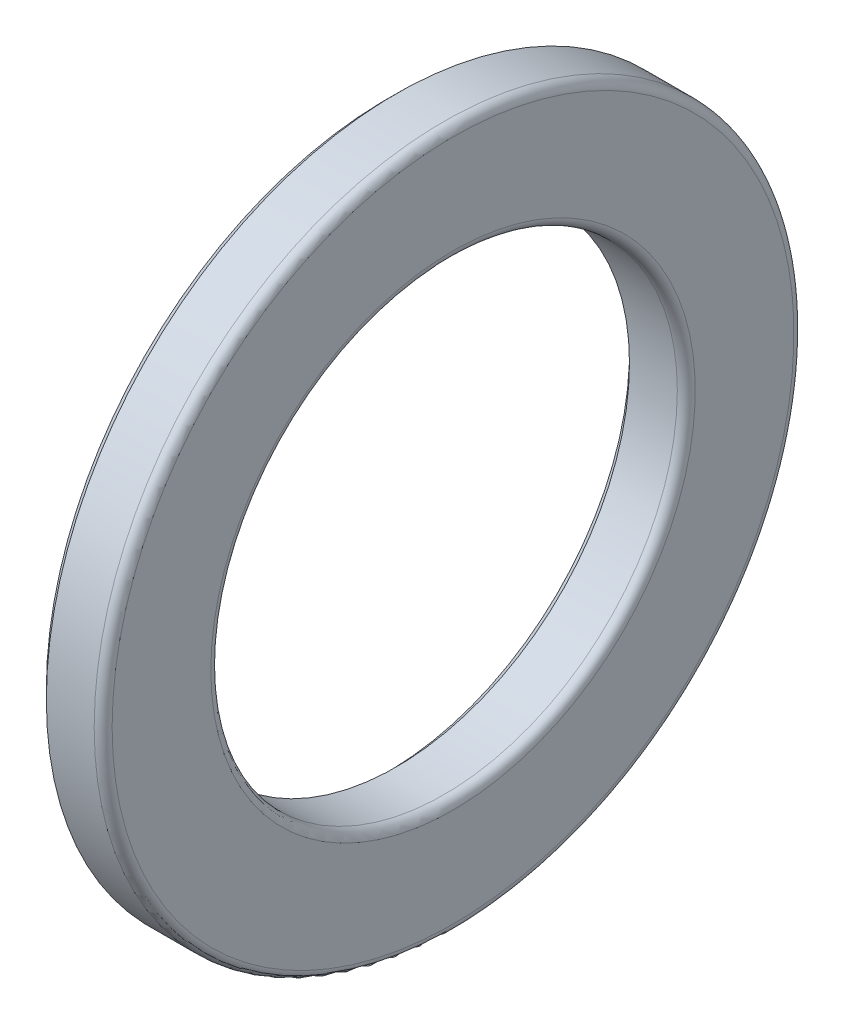
ISO-10303-21;
HEADER;
FILE_DESCRIPTION(('STEP AP214'),'2;1');
FILE_NAME('part.step','',(''),(''),'','','');
FILE_SCHEMA(('AUTOMOTIVE_DESIGN { 1 0 10303 214 1 1 1 1 }'));
ENDSEC;
DATA;
#1=APPLICATION_CONTEXT('core data for automotive mechanical design processes');
#2=APPLICATION_PROTOCOL_DEFINITION('international standard','automotive_design',2000,#1);
#3=PRODUCT_CONTEXT('',#1,'mechanical');
#4=PRODUCT('Part','Part','',(#3));
#5=PRODUCT_RELATED_PRODUCT_CATEGORY('part','',(#4));
#6=PRODUCT_DEFINITION_FORMATION('','',#4);
#7=PRODUCT_DEFINITION_CONTEXT('part definition',#1,'design');
#8=PRODUCT_DEFINITION('design','',#6,#7);
#9=PRODUCT_DEFINITION_SHAPE('','',#8);
#10=(LENGTH_UNIT() NAMED_UNIT(*) SI_UNIT(.MILLI.,.METRE.));
#11=(NAMED_UNIT(*) PLANE_ANGLE_UNIT() SI_UNIT($,.RADIAN.));
#12=(NAMED_UNIT(*) SI_UNIT($,.STERADIAN.) SOLID_ANGLE_UNIT());
#13=UNCERTAINTY_MEASURE_WITH_UNIT(LENGTH_MEASURE(1.E-05),#10,'distance_accuracy_value','');
#14=(GEOMETRIC_REPRESENTATION_CONTEXT(3) GLOBAL_UNCERTAINTY_ASSIGNED_CONTEXT((#13)) GLOBAL_UNIT_ASSIGNED_CONTEXT((#10,
#11,#12)) REPRESENTATION_CONTEXT('',''));
#15=CARTESIAN_POINT('',(0.,0.,0.));
#16=DIRECTION('',(0.,0.,1.));
#17=DIRECTION('',(1.,0.,0.));
#18=AXIS2_PLACEMENT_3D('',#15,#16,#17);
#19=CARTESIAN_POINT('',(14.6666666666667,0.,0.));
#20=DIRECTION('',(-1.,0.,0.));
#21=DIRECTION('',(0.,0.,1.));
#22=AXIS2_PLACEMENT_3D('',#19,#20,#21);
#23=CONICAL_SURFACE('',#22,27.,0.785398163397448);
#24=CARTESIAN_POINT('',(15.6666666666666,0.,0.));
#25=DIRECTION('',(-1.,0.,0.));
#26=DIRECTION('',(0.,0.,1.));
#27=AXIS2_PLACEMENT_3D('',#24,#25,#26);
#28=CIRCLE('',#27,26.);
#29=CARTESIAN_POINT('',(15.6666666666666,0.,26.));
#30=VERTEX_POINT('',#29);
#31=EDGE_CURVE('E10',#30,#30,#28,.T.);
#32=ORIENTED_EDGE('',*,*,#31,.F.);
#33=EDGE_LOOP('',(#32));
#34=FACE_BOUND('',#33,.T.);
#35=CARTESIAN_POINT('',(14.6666666666667,0.,0.));
#36=DIRECTION('',(-1.,0.,0.));
#37=DIRECTION('',(0.,0.,1.));
#38=AXIS2_PLACEMENT_3D('',#35,#36,#37);
#39=CIRCLE('',#38,27.);
#40=CARTESIAN_POINT('',(14.6666666666667,0.,27.));
#41=VERTEX_POINT('',#40);
#42=EDGE_CURVE('E64',#41,#41,#39,.T.);
#43=ORIENTED_EDGE('',*,*,#42,.T.);
#44=EDGE_LOOP('',(#43));
#45=FACE_BOUND('',#44,.T.);
#46=ADVANCED_FACE('F14',(#34,#45),#23,.F.);
#47=CARTESIAN_POINT('',(0.,0.,0.));
#48=DIRECTION('',(-1.,0.,0.));
#49=DIRECTION('',(0.,0.,1.));
#50=AXIS2_PLACEMENT_3D('',#47,#48,#49);
#51=CYLINDRICAL_SURFACE('',#50,26.);
#52=CARTESIAN_POINT('',(21.,0.,0.));
#53=DIRECTION('',(-1.,0.,0.));
#54=DIRECTION('',(0.,0.,1.));
#55=AXIS2_PLACEMENT_3D('',#52,#53,#54);
#56=CIRCLE('',#55,26.);
#57=CARTESIAN_POINT('',(21.,0.,26.));
#58=VERTEX_POINT('',#57);
#59=EDGE_CURVE('E21',#58,#58,#56,.T.);
#60=ORIENTED_EDGE('',*,*,#59,.F.);
#61=EDGE_LOOP('',(#60));
#62=FACE_BOUND('',#61,.T.);
#63=ORIENTED_EDGE('',*,*,#31,.T.);
#64=EDGE_LOOP('',(#63));
#65=FACE_BOUND('',#64,.T.);
#66=ADVANCED_FACE('F89',(#62,#65),#51,.F.);
#67=CARTESIAN_POINT('',(21.,0.,0.));
#68=DIRECTION('',(-1.,0.,0.));
#69=DIRECTION('',(0.,0.,1.));
#70=AXIS2_PLACEMENT_3D('',#67,#68,#69);
#71=TOROIDAL_SURFACE('',#70,27.,1.);
#72=CARTESIAN_POINT('',(22.,0.,0.));
#73=DIRECTION('',(-1.,0.,0.));
#74=DIRECTION('',(0.,0.,1.));
#75=AXIS2_PLACEMENT_3D('',#72,#73,#74);
#76=CIRCLE('',#75,27.);
#77=CARTESIAN_POINT('',(22.,0.,27.));
#78=VERTEX_POINT('',#77);
#79=EDGE_CURVE('E30',#78,#78,#76,.T.);
#80=ORIENTED_EDGE('',*,*,#79,.F.);
#81=EDGE_LOOP('',(#80));
#82=FACE_BOUND('',#81,.T.);
#83=ORIENTED_EDGE('',*,*,#59,.T.);
#84=EDGE_LOOP('',(#83));
#85=FACE_BOUND('',#84,.T.);
#86=ADVANCED_FACE('F94',(#82,#85),#71,.T.);
#87=CARTESIAN_POINT('',(22.,27.,0.));
#88=DIRECTION('',(-1.,0.,0.));
#89=DIRECTION('',(0.,0.,1.));
#90=AXIS2_PLACEMENT_3D('',#87,#88,#89);
#91=PLANE('',#90);
#92=CARTESIAN_POINT('',(22.,0.,0.));
#93=DIRECTION('',(-1.,0.,0.));
#94=DIRECTION('',(0.,0.,1.));
#95=AXIS2_PLACEMENT_3D('',#92,#93,#94);
#96=CIRCLE('',#95,38.);
#97=CARTESIAN_POINT('',(22.,0.,38.));
#98=VERTEX_POINT('',#97);
#99=EDGE_CURVE('E38',#98,#98,#96,.T.);
#100=ORIENTED_EDGE('',*,*,#99,.F.);
#101=EDGE_LOOP('',(#100));
#102=FACE_BOUND('',#101,.T.);
#103=ORIENTED_EDGE('',*,*,#79,.T.);
#104=EDGE_LOOP('',(#103));
#105=FACE_BOUND('',#104,.T.);
#106=ADVANCED_FACE('F99',(#102,#105),#91,.F.);
#107=CARTESIAN_POINT('',(21.,0.,0.));
#108=DIRECTION('',(-1.,0.,0.));
#109=DIRECTION('',(0.,0.,1.));
#110=AXIS2_PLACEMENT_3D('',#107,#108,#109);
#111=TOROIDAL_SURFACE('',#110,38.,1.);
#112=CARTESIAN_POINT('',(21.,0.,0.));
#113=DIRECTION('',(-1.,0.,0.));
#114=DIRECTION('',(0.,0.,1.));
#115=AXIS2_PLACEMENT_3D('',#112,#113,#114);
#116=CIRCLE('',#115,39.);
#117=CARTESIAN_POINT('',(21.,0.,39.));
#118=VERTEX_POINT('',#117);
#119=EDGE_CURVE('E44',#118,#118,#116,.T.);
#120=ORIENTED_EDGE('',*,*,#119,.F.);
#121=EDGE_LOOP('',(#120));
#122=FACE_BOUND('',#121,.T.);
#123=ORIENTED_EDGE('',*,*,#99,.T.);
#124=EDGE_LOOP('',(#123));
#125=FACE_BOUND('',#124,.T.);
#126=ADVANCED_FACE('F105',(#122,#125),#111,.T.);
#127=CARTESIAN_POINT('',(0.,0.,0.));
#128=DIRECTION('',(-1.,0.,0.));
#129=DIRECTION('',(0.,0.,1.));
#130=AXIS2_PLACEMENT_3D('',#127,#128,#129);
#131=CYLINDRICAL_SURFACE('',#130,39.);
#132=CARTESIAN_POINT('',(15.6666666666666,0.,0.));
#133=DIRECTION('',(-1.,0.,0.));
#134=DIRECTION('',(0.,0.,1.));
#135=AXIS2_PLACEMENT_3D('',#132,#133,#134);
#136=CIRCLE('',#135,39.);
#137=CARTESIAN_POINT('',(15.6666666666666,0.,39.));
#138=VERTEX_POINT('',#137);
#139=EDGE_CURVE('E48',#138,#138,#136,.T.);
#140=ORIENTED_EDGE('',*,*,#139,.F.);
#141=EDGE_LOOP('',(#140));
#142=FACE_BOUND('',#141,.T.);
#143=ORIENTED_EDGE('',*,*,#119,.T.);
#144=EDGE_LOOP('',(#143));
#145=FACE_BOUND('',#144,.T.);
#146=ADVANCED_FACE('F109',(#142,#145),#131,.T.);
#147=CARTESIAN_POINT('',(15.6666666666666,0.,0.));
#148=DIRECTION('',(1.,0.,0.));
#149=DIRECTION('',(0.,0.,-1.));
#150=AXIS2_PLACEMENT_3D('',#147,#148,#149);
#151=CONICAL_SURFACE('',#150,39.,0.785398163397448);
#152=CARTESIAN_POINT('',(14.6666666666667,0.,0.));
#153=DIRECTION('',(-1.,0.,0.));
#154=DIRECTION('',(0.,0.,1.));
#155=AXIS2_PLACEMENT_3D('',#152,#153,#154);
#156=CIRCLE('',#155,38.);
#157=CARTESIAN_POINT('',(14.6666666666667,0.,38.));
#158=VERTEX_POINT('',#157);
#159=EDGE_CURVE('E52',#158,#158,#156,.T.);
#160=ORIENTED_EDGE('',*,*,#159,.F.);
#161=EDGE_LOOP('',(#160));
#162=FACE_BOUND('',#161,.T.);
#163=ORIENTED_EDGE('',*,*,#139,.T.);
#164=EDGE_LOOP('',(#163));
#165=FACE_BOUND('',#164,.T.);
#166=ADVANCED_FACE('F85',(#162,#165),#151,.T.);
#167=CARTESIAN_POINT('',(14.6666666666667,38.,0.));
#168=DIRECTION('',(1.,0.,0.));
#169=DIRECTION('',(0.,0.,-1.));
#170=AXIS2_PLACEMENT_3D('',#167,#168,#169);
#171=PLANE('',#170);
#172=CARTESIAN_POINT('',(14.6666666666667,0.,0.));
#173=DIRECTION('',(-1.,0.,0.));
#174=DIRECTION('',(0.,0.,1.));
#175=AXIS2_PLACEMENT_3D('',#172,#173,#174);
#176=CIRCLE('',#175,36.0994579587496);
#177=CARTESIAN_POINT('',(14.6666666666667,0.,36.0994579587496));
#178=VERTEX_POINT('',#177);
#179=EDGE_CURVE('E56',#178,#178,#176,.T.);
#180=ORIENTED_EDGE('',*,*,#179,.F.);
#181=EDGE_LOOP('',(#180));
#182=FACE_BOUND('',#181,.T.);
#183=ORIENTED_EDGE('',*,*,#159,.T.);
#184=EDGE_LOOP('',(#183));
#185=FACE_BOUND('',#184,.T.);
#186=ADVANCED_FACE('F78',(#182,#185),#171,.F.);
#187=CARTESIAN_POINT('',(11.,0.,0.));
#188=DIRECTION('',(-1.,0.,0.));
#189=DIRECTION('',(0.,0.,1.));
#190=AXIS2_PLACEMENT_3D('',#187,#188,#189);
#191=TOROIDAL_SURFACE('',#190,32.,5.5);
#192=ORIENTED_EDGE('',*,*,#179,.T.);
#193=EDGE_LOOP('',(#192));
#194=FACE_BOUND('',#193,.T.);
#195=CARTESIAN_POINT('',(14.6666666666667,0.,0.));
#196=DIRECTION('',(-1.,0.,0.));
#197=DIRECTION('',(0.,0.,1.));
#198=AXIS2_PLACEMENT_3D('',#195,#196,#197);
#199=CIRCLE('',#198,27.9005420412504);
#200=CARTESIAN_POINT('',(14.6666666666667,0.,27.9005420412504));
#201=VERTEX_POINT('',#200);
#202=EDGE_CURVE('E60',#201,#201,#199,.T.);
#203=ORIENTED_EDGE('',*,*,#202,.F.);
#204=EDGE_LOOP('',(#203));
#205=FACE_BOUND('',#204,.T.);
#206=ADVANCED_FACE('F73',(#194,#205),#191,.F.);
#207=CARTESIAN_POINT('',(14.6666666666667,27.9005420412504,0.));
#208=DIRECTION('',(1.,0.,0.));
#209=DIRECTION('',(0.,0.,-1.));
#210=AXIS2_PLACEMENT_3D('',#207,#208,#209);
#211=PLANE('',#210);
#212=ORIENTED_EDGE('',*,*,#42,.F.);
#213=EDGE_LOOP('',(#212));
#214=FACE_BOUND('',#213,.T.);
#215=ORIENTED_EDGE('',*,*,#202,.T.);
#216=EDGE_LOOP('',(#215));
#217=FACE_BOUND('',#216,.T.);
#218=ADVANCED_FACE('F70',(#214,#217),#211,.F.);
#219=CLOSED_SHELL('',(#46,#66,#86,#106,#126,#146,#166,#186,#206,#218));
#220=MANIFOLD_SOLID_BREP('B1',#219);
#221=ADVANCED_BREP_SHAPE_REPRESENTATION('',(#18,#220),#14);
#222=SHAPE_DEFINITION_REPRESENTATION(#9,#221);
ENDSEC;
END-ISO-10303-21;
